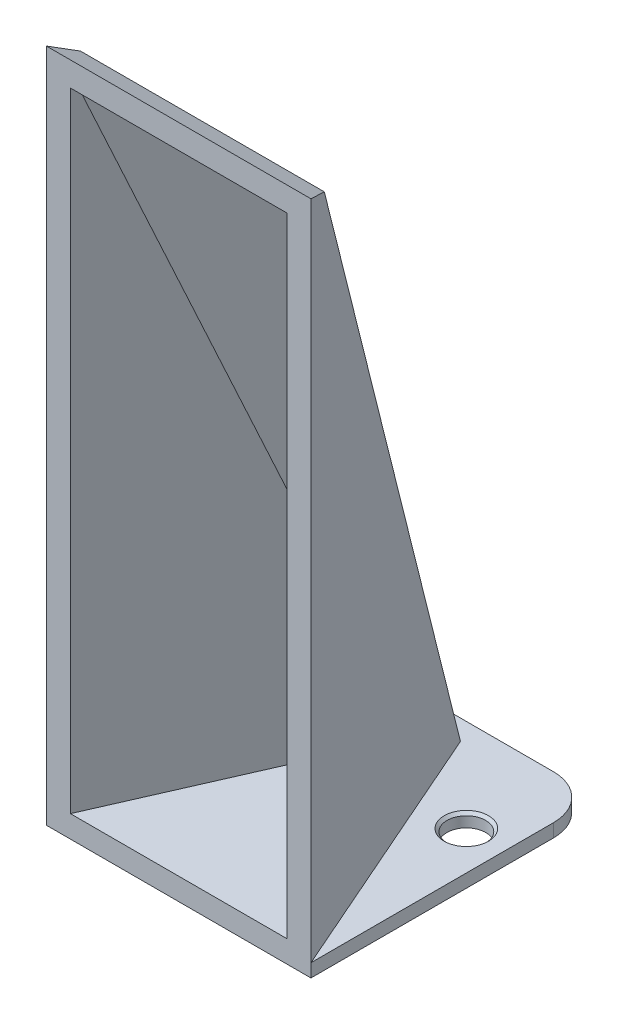
ISO-10303-21;
HEADER;
FILE_DESCRIPTION(('STEP AP214'),'2;1');
FILE_NAME('part.step','',(''),(''),'','','');
FILE_SCHEMA(('AUTOMOTIVE_DESIGN { 1 0 10303 214 1 1 1 1 }'));
ENDSEC;
DATA;
#1=APPLICATION_CONTEXT('core data for automotive mechanical design processes');
#2=APPLICATION_PROTOCOL_DEFINITION('international standard','automotive_design',2000,#1);
#3=PRODUCT_CONTEXT('',#1,'mechanical');
#4=PRODUCT('Part','Part','',(#3));
#5=PRODUCT_RELATED_PRODUCT_CATEGORY('part','',(#4));
#6=PRODUCT_DEFINITION_FORMATION('','',#4);
#7=PRODUCT_DEFINITION_CONTEXT('part definition',#1,'design');
#8=PRODUCT_DEFINITION('design','',#6,#7);
#9=PRODUCT_DEFINITION_SHAPE('','',#8);
#10=(LENGTH_UNIT() NAMED_UNIT(*) SI_UNIT(.MILLI.,.METRE.));
#11=(NAMED_UNIT(*) PLANE_ANGLE_UNIT() SI_UNIT($,.RADIAN.));
#12=(NAMED_UNIT(*) SI_UNIT($,.STERADIAN.) SOLID_ANGLE_UNIT());
#13=UNCERTAINTY_MEASURE_WITH_UNIT(LENGTH_MEASURE(1.E-05),#10,'distance_accuracy_value','');
#14=(GEOMETRIC_REPRESENTATION_CONTEXT(3) GLOBAL_UNCERTAINTY_ASSIGNED_CONTEXT((#13)) GLOBAL_UNIT_ASSIGNED_CONTEXT((#10,
#11,#12)) REPRESENTATION_CONTEXT('',''));
#15=CARTESIAN_POINT('',(0.,0.,0.));
#16=DIRECTION('',(0.,0.,1.));
#17=DIRECTION('',(1.,0.,0.));
#18=AXIS2_PLACEMENT_3D('',#15,#16,#17);
#19=CARTESIAN_POINT('',(0.,3.,0.));
#20=DIRECTION('',(0.,0.,-1.));
#21=DIRECTION('',(-1.,0.,0.));
#22=AXIS2_PLACEMENT_3D('',#19,#20,#21);
#23=PLANE('',#22);
#24=DIRECTION('',(1.,0.,0.));
#25=VECTOR('',#24,1.);
#26=CARTESIAN_POINT('',(0.,0.,0.));
#27=LINE('',#26,#25);
#28=CARTESIAN_POINT('',(0.,0.,0.));
#29=VERTEX_POINT('',#28);
#30=CARTESIAN_POINT('',(60.,0.,0.));
#31=VERTEX_POINT('',#30);
#32=EDGE_CURVE('E258',#29,#31,#27,.T.);
#33=ORIENTED_EDGE('',*,*,#32,.T.);
#34=DIRECTION('',(0.,-1.,0.));
#35=VECTOR('',#34,1.);
#36=CARTESIAN_POINT('',(60.,3.,0.));
#37=LINE('',#36,#35);
#38=CARTESIAN_POINT('',(60.,3.,0.));
#39=VERTEX_POINT('',#38);
#40=EDGE_CURVE('E255',#39,#31,#37,.T.);
#41=ORIENTED_EDGE('',*,*,#40,.F.);
#42=DIRECTION('',(0.,-1.,0.));
#43=VECTOR('',#42,1.);
#44=CARTESIAN_POINT('',(60.,153.,0.));
#45=LINE('',#44,#43);
#46=CARTESIAN_POINT('',(60.,153.,0.));
#47=VERTEX_POINT('',#46);
#48=EDGE_CURVE('E225',#47,#39,#45,.T.);
#49=ORIENTED_EDGE('',*,*,#48,.F.);
#50=DIRECTION('',(1.,0.,0.));
#51=VECTOR('',#50,1.);
#52=CARTESIAN_POINT('',(0.,153.,0.));
#53=LINE('',#52,#51);
#54=CARTESIAN_POINT('',(0.,153.,0.));
#55=VERTEX_POINT('',#54);
#56=EDGE_CURVE('E222',#55,#47,#53,.T.);
#57=ORIENTED_EDGE('',*,*,#56,.F.);
#58=DIRECTION('',(0.,-1.,0.));
#59=VECTOR('',#58,1.);
#60=CARTESIAN_POINT('',(0.,153.,0.));
#61=LINE('',#60,#59);
#62=CARTESIAN_POINT('',(0.,3.,0.));
#63=VERTEX_POINT('',#62);
#64=EDGE_CURVE('E239',#55,#63,#61,.T.);
#65=ORIENTED_EDGE('',*,*,#64,.T.);
#66=DIRECTION('',(0.,-1.,0.));
#67=VECTOR('',#66,1.);
#68=CARTESIAN_POINT('',(0.,3.,0.));
#69=LINE('',#68,#67);
#70=EDGE_CURVE('E271',#63,#29,#69,.T.);
#71=ORIENTED_EDGE('',*,*,#70,.T.);
#72=EDGE_LOOP('',(#33,#41,#49,#57,#65,#71));
#73=FACE_BOUND('',#72,.T.);
#74=DIRECTION('',(0.,-1.,0.));
#75=VECTOR('',#74,1.);
#76=CARTESIAN_POINT('',(5.4601731754912,3.,0.));
#77=LINE('',#76,#75);
#78=CARTESIAN_POINT('',(5.4601731754912,147.484719584209,0.));
#79=VERTEX_POINT('',#78);
#80=CARTESIAN_POINT('',(5.4601731754912,5.,0.));
#81=VERTEX_POINT('',#80);
#82=EDGE_CURVE('E186',#79,#81,#77,.T.);
#83=ORIENTED_EDGE('',*,*,#82,.F.);
#84=DIRECTION('',(1.,0.,0.));
#85=VECTOR('',#84,1.);
#86=CARTESIAN_POINT('',(150.,147.484719584209,0.));
#87=LINE('',#86,#85);
#88=CARTESIAN_POINT('',(54.5398268245088,147.484719584209,0.));
#89=VERTEX_POINT('',#88);
#90=EDGE_CURVE('E178',#79,#89,#87,.T.);
#91=ORIENTED_EDGE('',*,*,#90,.T.);
#92=DIRECTION('',(0.,-1.,0.));
#93=VECTOR('',#92,1.);
#94=CARTESIAN_POINT('',(54.5398268245088,153.,0.));
#95=LINE('',#94,#93);
#96=CARTESIAN_POINT('',(54.5398268245088,5.00000000000003,0.));
#97=VERTEX_POINT('',#96);
#98=EDGE_CURVE('E163',#89,#97,#95,.T.);
#99=ORIENTED_EDGE('',*,*,#98,.T.);
#100=DIRECTION('',(1.,0.,0.));
#101=VECTOR('',#100,1.);
#102=CARTESIAN_POINT('',(0.,5.,0.));
#103=LINE('',#102,#101);
#104=EDGE_CURVE('E181',#81,#97,#103,.T.);
#105=ORIENTED_EDGE('',*,*,#104,.F.);
#106=EDGE_LOOP('',(#83,#91,#99,#105));
#107=FACE_BOUND('',#106,.T.);
#108=ADVANCED_FACE('F49',(#73,#107),#23,.F.);
#109=CARTESIAN_POINT('',(0.,3.,0.));
#110=DIRECTION('',(0.,-1.,0.));
#111=DIRECTION('',(0.,0.,-1.));
#112=AXIS2_PLACEMENT_3D('',#109,#110,#111);
#113=PLANE('',#112);
#114=CARTESIAN_POINT('',(51.25,3.,-43.9809153789311));
#115=DIRECTION('',(0.,1.,0.));
#116=DIRECTION('',(0.,0.,1.));
#117=AXIS2_PLACEMENT_3D('',#114,#115,#116);
#118=CIRCLE('',#117,5.025);
#119=CARTESIAN_POINT('',(51.25,3.,-38.9559153789311));
#120=VERTEX_POINT('',#119);
#121=EDGE_CURVE('E403',#120,#120,#118,.T.);
#122=ORIENTED_EDGE('',*,*,#121,.F.);
#123=EDGE_LOOP('',(#122));
#124=FACE_BOUND('',#123,.T.);
#125=CARTESIAN_POINT('',(8.75,3.,-43.9809153789311));
#126=DIRECTION('',(0.,1.,0.));
#127=DIRECTION('',(0.,0.,1.));
#128=AXIS2_PLACEMENT_3D('',#125,#126,#127);
#129=CIRCLE('',#128,5.025);
#130=CARTESIAN_POINT('',(8.75,3.,-38.9559153789311));
#131=VERTEX_POINT('',#130);
#132=EDGE_CURVE('E413',#131,#131,#129,.T.);
#133=ORIENTED_EDGE('',*,*,#132,.F.);
#134=EDGE_LOOP('',(#133));
#135=FACE_BOUND('',#134,.T.);
#136=DIRECTION('',(0.,0.,-1.));
#137=VECTOR('',#136,1.);
#138=CARTESIAN_POINT('',(60.,3.,0.));
#139=LINE('',#138,#137);
#140=CARTESIAN_POINT('',(60.,3.,-55.));
#141=VERTEX_POINT('',#140);
#142=EDGE_CURVE('E247',#39,#141,#139,.T.);
#143=ORIENTED_EDGE('',*,*,#142,.T.);
#144=CARTESIAN_POINT('',(50.,3.,-55.));
#145=DIRECTION('',(0.,-1.,0.));
#146=DIRECTION('',(0.,0.,-1.));
#147=AXIS2_PLACEMENT_3D('',#144,#145,#146);
#148=CIRCLE('',#147,10.);
#149=CARTESIAN_POINT('',(50.,3.,-65.));
#150=VERTEX_POINT('',#149);
#151=EDGE_CURVE('E58',#141,#150,#148,.F.);
#152=ORIENTED_EDGE('',*,*,#151,.T.);
#153=DIRECTION('',(-1.,0.,0.));
#154=VECTOR('',#153,1.);
#155=CARTESIAN_POINT('',(0.,3.,-65.));
#156=LINE('',#155,#154);
#157=CARTESIAN_POINT('',(10.,3.,-65.));
#158=VERTEX_POINT('',#157);
#159=EDGE_CURVE('E252',#150,#158,#156,.T.);
#160=ORIENTED_EDGE('',*,*,#159,.T.);
#161=CARTESIAN_POINT('',(10.,3.,-55.));
#162=DIRECTION('',(0.,-1.,0.));
#163=DIRECTION('',(0.,0.,-1.));
#164=AXIS2_PLACEMENT_3D('',#161,#162,#163);
#165=CIRCLE('',#164,10.);
#166=CARTESIAN_POINT('',(0.,3.,-55.));
#167=VERTEX_POINT('',#166);
#168=EDGE_CURVE('E73',#158,#167,#165,.F.);
#169=ORIENTED_EDGE('',*,*,#168,.T.);
#170=DIRECTION('',(0.,0.,1.));
#171=VECTOR('',#170,1.);
#172=CARTESIAN_POINT('',(0.,3.,0.));
#173=LINE('',#172,#171);
#174=EDGE_CURVE('E244',#167,#63,#173,.T.);
#175=ORIENTED_EDGE('',*,*,#174,.T.);
#176=DIRECTION('',(-0.401812709745102,0.,0.91572187168774));
#177=VECTOR('',#176,1.);
#178=CARTESIAN_POINT('',(26.5,3.,-60.3928870620323));
#179=LINE('',#178,#177);
#180=CARTESIAN_POINT('',(26.5,3.,-60.3928870620323));
#181=VERTEX_POINT('',#180);
#182=EDGE_CURVE('E221',#181,#63,#179,.T.);
#183=ORIENTED_EDGE('',*,*,#182,.F.);
#184=DIRECTION('',(-1.,0.,0.));
#185=VECTOR('',#184,1.);
#186=CARTESIAN_POINT('',(33.5,3.,-60.3928870620323));
#187=LINE('',#186,#185);
#188=CARTESIAN_POINT('',(33.5,3.,-60.3928870620323));
#189=VERTEX_POINT('',#188);
#190=EDGE_CURVE('E226',#189,#181,#187,.T.);
#191=ORIENTED_EDGE('',*,*,#190,.F.);
#192=DIRECTION('',(-0.401812709745102,0.,-0.91572187168774));
#193=VECTOR('',#192,1.);
#194=CARTESIAN_POINT('',(60.,3.,0.));
#195=LINE('',#194,#193);
#196=EDGE_CURVE('E230',#39,#189,#195,.T.);
#197=ORIENTED_EDGE('',*,*,#196,.F.);
#198=EDGE_LOOP('',(#143,#152,#160,#169,#175,#183,#191,#197));
#199=FACE_BOUND('',#198,.T.);
#200=ADVANCED_FACE('F295',(#124,#135,#199),#113,.F.);
#201=CARTESIAN_POINT('',(0.,3.,0.));
#202=DIRECTION('',(1.,0.,0.));
#203=DIRECTION('',(0.,0.,-1.));
#204=AXIS2_PLACEMENT_3D('',#201,#202,#203);
#205=PLANE('',#204);
#206=ORIENTED_EDGE('',*,*,#174,.F.);
#207=DIRECTION('',(0.,-1.,0.));
#208=VECTOR('',#207,1.);
#209=CARTESIAN_POINT('',(0.,3.,-55.));
#210=LINE('',#209,#208);
#211=CARTESIAN_POINT('',(0.,0.,-55.));
#212=VERTEX_POINT('',#211);
#213=EDGE_CURVE('E11',#167,#212,#210,.T.);
#214=ORIENTED_EDGE('',*,*,#213,.T.);
#215=DIRECTION('',(0.,0.,1.));
#216=VECTOR('',#215,1.);
#217=CARTESIAN_POINT('',(0.,0.,0.));
#218=LINE('',#217,#216);
#219=EDGE_CURVE('E243',#212,#29,#218,.T.);
#220=ORIENTED_EDGE('',*,*,#219,.T.);
#221=ORIENTED_EDGE('',*,*,#70,.F.);
#222=EDGE_LOOP('',(#206,#214,#220,#221));
#223=FACE_BOUND('',#222,.T.);
#224=ADVANCED_FACE('F319',(#223),#205,.F.);
#225=CARTESIAN_POINT('',(60.,3.,0.));
#226=DIRECTION('',(-1.,0.,0.));
#227=DIRECTION('',(0.,0.,1.));
#228=AXIS2_PLACEMENT_3D('',#225,#226,#227);
#229=PLANE('',#228);
#230=DIRECTION('',(0.,0.,-1.));
#231=VECTOR('',#230,1.);
#232=CARTESIAN_POINT('',(60.,0.,0.));
#233=LINE('',#232,#231);
#234=CARTESIAN_POINT('',(60.,0.,-55.));
#235=VERTEX_POINT('',#234);
#236=EDGE_CURVE('E261',#31,#235,#233,.T.);
#237=ORIENTED_EDGE('',*,*,#236,.T.);
#238=DIRECTION('',(0.,-1.,0.));
#239=VECTOR('',#238,1.);
#240=CARTESIAN_POINT('',(60.,3.,-55.));
#241=LINE('',#240,#239);
#242=EDGE_CURVE('E288',#235,#141,#241,.F.);
#243=ORIENTED_EDGE('',*,*,#242,.T.);
#244=ORIENTED_EDGE('',*,*,#142,.F.);
#245=ORIENTED_EDGE('',*,*,#40,.T.);
#246=EDGE_LOOP('',(#237,#243,#244,#245));
#247=FACE_BOUND('',#246,.T.);
#248=ADVANCED_FACE('F310',(#247),#229,.F.);
#249=CARTESIAN_POINT('',(0.,3.,-65.));
#250=DIRECTION('',(0.,0.,1.));
#251=DIRECTION('',(1.,0.,0.));
#252=AXIS2_PLACEMENT_3D('',#249,#250,#251);
#253=PLANE('',#252);
#254=ORIENTED_EDGE('',*,*,#159,.F.);
#255=DIRECTION('',(0.,-1.,0.));
#256=VECTOR('',#255,1.);
#257=CARTESIAN_POINT('',(50.,3.,-65.));
#258=LINE('',#257,#256);
#259=CARTESIAN_POINT('',(50.,0.,-65.));
#260=VERTEX_POINT('',#259);
#261=EDGE_CURVE('E278',#150,#260,#258,.T.);
#262=ORIENTED_EDGE('',*,*,#261,.T.);
#263=DIRECTION('',(-1.,0.,0.));
#264=VECTOR('',#263,1.);
#265=CARTESIAN_POINT('',(0.,0.,-65.));
#266=LINE('',#265,#264);
#267=CARTESIAN_POINT('',(10.,0.,-65.));
#268=VERTEX_POINT('',#267);
#269=EDGE_CURVE('E248',#260,#268,#266,.T.);
#270=ORIENTED_EDGE('',*,*,#269,.T.);
#271=DIRECTION('',(0.,-1.,0.));
#272=VECTOR('',#271,1.);
#273=CARTESIAN_POINT('',(10.,3.,-65.));
#274=LINE('',#273,#272);
#275=EDGE_CURVE('E275',#268,#158,#274,.F.);
#276=ORIENTED_EDGE('',*,*,#275,.T.);
#277=EDGE_LOOP('',(#254,#262,#270,#276));
#278=FACE_BOUND('',#277,.T.);
#279=ADVANCED_FACE('F301',(#278),#253,.F.);
#280=CARTESIAN_POINT('',(0.,0.,0.));
#281=DIRECTION('',(0.,-1.,0.));
#282=DIRECTION('',(0.,0.,-1.));
#283=AXIS2_PLACEMENT_3D('',#280,#281,#282);
#284=PLANE('',#283);
#285=CARTESIAN_POINT('',(51.25,0.,-43.9809153789311));
#286=DIRECTION('',(0.,1.,0.));
#287=DIRECTION('',(0.,0.,1.));
#288=AXIS2_PLACEMENT_3D('',#285,#286,#287);
#289=CIRCLE('',#288,4.39999999999999);
#290=CARTESIAN_POINT('',(51.25,0.,-39.5809153789311));
#291=VERTEX_POINT('',#290);
#292=EDGE_CURVE('E407',#291,#291,#289,.T.);
#293=ORIENTED_EDGE('',*,*,#292,.T.);
#294=EDGE_LOOP('',(#293));
#295=FACE_BOUND('',#294,.T.);
#296=CARTESIAN_POINT('',(8.75,0.,-43.9809153789311));
#297=DIRECTION('',(0.,1.,0.));
#298=DIRECTION('',(0.,0.,1.));
#299=AXIS2_PLACEMENT_3D('',#296,#297,#298);
#300=CIRCLE('',#299,4.4);
#301=CARTESIAN_POINT('',(8.75,0.,-39.5809153789311));
#302=VERTEX_POINT('',#301);
#303=EDGE_CURVE('E169',#302,#302,#300,.T.);
#304=ORIENTED_EDGE('',*,*,#303,.T.);
#305=EDGE_LOOP('',(#304));
#306=FACE_BOUND('',#305,.T.);
#307=ORIENTED_EDGE('',*,*,#269,.F.);
#308=CARTESIAN_POINT('',(50.,0.,-55.));
#309=DIRECTION('',(0.,-1.,0.));
#310=DIRECTION('',(0.,0.,-1.));
#311=AXIS2_PLACEMENT_3D('',#308,#309,#310);
#312=CIRCLE('',#311,10.);
#313=EDGE_CURVE('E285',#260,#235,#312,.T.);
#314=ORIENTED_EDGE('',*,*,#313,.T.);
#315=ORIENTED_EDGE('',*,*,#236,.F.);
#316=ORIENTED_EDGE('',*,*,#32,.F.);
#317=ORIENTED_EDGE('',*,*,#219,.F.);
#318=CARTESIAN_POINT('',(10.,0.,-55.));
#319=DIRECTION('',(0.,-1.,0.));
#320=DIRECTION('',(0.,0.,-1.));
#321=AXIS2_PLACEMENT_3D('',#318,#319,#320);
#322=CIRCLE('',#321,10.);
#323=EDGE_CURVE('E282',#212,#268,#322,.T.);
#324=ORIENTED_EDGE('',*,*,#323,.T.);
#325=EDGE_LOOP('',(#307,#314,#315,#316,#317,#324));
#326=FACE_BOUND('',#325,.T.);
#327=ADVANCED_FACE('F307',(#295,#306,#326),#284,.T.);
#328=CARTESIAN_POINT('',(26.5,153.,-60.3928870620323));
#329=DIRECTION('',(0.91572187168774,0.,0.401812709745102));
#330=DIRECTION('',(0.401812709745102,0.,-0.91572187168774));
#331=AXIS2_PLACEMENT_3D('',#328,#329,#330);
#332=PLANE('',#331);
#333=ORIENTED_EDGE('',*,*,#64,.F.);
#334=DIRECTION('',(0.369626086704801,-0.392161337537618,-0.842369302246943));
#335=VECTOR('',#334,1.);
#336=CARTESIAN_POINT('',(22.4245513615287,129.208275411466,-51.1050338790017));
#337=LINE('',#336,#335);
#338=CARTESIAN_POINT('',(2.36589220792604,150.489864795525,-5.39181361940447));
#339=VERTEX_POINT('',#338);
#340=EDGE_CURVE('E209',#55,#339,#337,.T.);
#341=ORIENTED_EDGE('',*,*,#340,.T.);
#342=DIRECTION('',(0.151547747986444,-0.926148049605033,-0.345373812401912));
#343=VECTOR('',#342,1.);
#344=CARTESIAN_POINT('',(5.44665231704794,131.662531468081,-12.4127946509295));
#345=LINE('',#344,#343);
#346=EDGE_CURVE('E217',#339,#181,#345,.T.);
#347=ORIENTED_EDGE('',*,*,#346,.T.);
#348=ORIENTED_EDGE('',*,*,#182,.T.);
#349=EDGE_LOOP('',(#333,#341,#347,#348));
#350=FACE_BOUND('',#349,.T.);
#351=ADVANCED_FACE('F351',(#350),#332,.F.);
#352=CARTESIAN_POINT('',(60.,153.,0.));
#353=DIRECTION('',(-0.91572187168774,0.,0.401812709745102));
#354=DIRECTION('',(0.401812709745102,0.,0.91572187168774));
#355=AXIS2_PLACEMENT_3D('',#352,#353,#354);
#356=PLANE('',#355);
#357=DIRECTION('',(0.151547747986444,0.926148049605033,0.345373812401912));
#358=VECTOR('',#357,1.);
#359=CARTESIAN_POINT('',(58.3229671235911,154.6996649068,-3.82191913601051));
#360=LINE('',#359,#358);
#361=CARTESIAN_POINT('',(57.634107792074,150.489864795525,-5.39181361940447));
#362=VERTEX_POINT('',#361);
#363=EDGE_CURVE('E213',#189,#362,#360,.T.);
#364=ORIENTED_EDGE('',*,*,#363,.T.);
#365=DIRECTION('',(0.369626086704801,0.392161337537618,0.842369302246943));
#366=VECTOR('',#365,1.);
#367=CARTESIAN_POINT('',(60.,153.,0.));
#368=LINE('',#367,#366);
#369=EDGE_CURVE('E205',#362,#47,#368,.T.);
#370=ORIENTED_EDGE('',*,*,#369,.T.);
#371=ORIENTED_EDGE('',*,*,#48,.T.);
#372=ORIENTED_EDGE('',*,*,#196,.T.);
#373=EDGE_LOOP('',(#364,#370,#371,#372));
#374=FACE_BOUND('',#373,.T.);
#375=ADVANCED_FACE('F357',(#374),#356,.F.);
#376=CARTESIAN_POINT('',(150.,3.,-60.3928870620323));
#377=DIRECTION('',(0.,-0.34940951392497,0.936970112425533));
#378=DIRECTION('',(0.,-0.936970112425533,-0.34940951392497));
#379=AXIS2_PLACEMENT_3D('',#376,#377,#378);
#380=PLANE('',#379);
#381=DIRECTION('',(-1.,0.,0.));
#382=VECTOR('',#381,1.);
#383=CARTESIAN_POINT('',(150.,150.489864795525,-5.39181361940447));
#384=LINE('',#383,#382);
#385=EDGE_CURVE('E201',#362,#339,#384,.T.);
#386=ORIENTED_EDGE('',*,*,#385,.F.);
#387=ORIENTED_EDGE('',*,*,#363,.F.);
#388=ORIENTED_EDGE('',*,*,#190,.T.);
#389=ORIENTED_EDGE('',*,*,#346,.F.);
#390=EDGE_LOOP('',(#386,#387,#388,#389));
#391=FACE_BOUND('',#390,.T.);
#392=ADVANCED_FACE('F361',(#391),#380,.F.);
#393=CARTESIAN_POINT('',(150.,150.489864795525,-5.39181361940447));
#394=DIRECTION('',(0.,-0.906572218102276,0.422050723687473));
#395=DIRECTION('',(0.,-0.422050723687473,-0.906572218102276));
#396=AXIS2_PLACEMENT_3D('',#393,#394,#395);
#397=PLANE('',#396);
#398=ORIENTED_EDGE('',*,*,#56,.T.);
#399=ORIENTED_EDGE('',*,*,#369,.F.);
#400=ORIENTED_EDGE('',*,*,#385,.T.);
#401=ORIENTED_EDGE('',*,*,#340,.F.);
#402=EDGE_LOOP('',(#398,#399,#400,#401));
#403=FACE_BOUND('',#402,.T.);
#404=ADVANCED_FACE('F330',(#403),#397,.F.);
#405=CARTESIAN_POINT('',(50.,3.,-55.));
#406=DIRECTION('',(0.,-1.,0.));
#407=DIRECTION('',(0.,0.,-1.));
#408=AXIS2_PLACEMENT_3D('',#405,#406,#407);
#409=CYLINDRICAL_SURFACE('',#408,10.);
#410=ORIENTED_EDGE('',*,*,#151,.F.);
#411=ORIENTED_EDGE('',*,*,#242,.F.);
#412=ORIENTED_EDGE('',*,*,#313,.F.);
#413=ORIENTED_EDGE('',*,*,#261,.F.);
#414=EDGE_LOOP('',(#410,#411,#412,#413));
#415=FACE_BOUND('',#414,.T.);
#416=ADVANCED_FACE('F304',(#415),#409,.T.);
#417=CARTESIAN_POINT('',(10.,3.,-55.));
#418=DIRECTION('',(0.,-1.,0.));
#419=DIRECTION('',(0.,0.,-1.));
#420=AXIS2_PLACEMENT_3D('',#417,#418,#419);
#421=CYLINDRICAL_SURFACE('',#420,10.);
#422=ORIENTED_EDGE('',*,*,#168,.F.);
#423=ORIENTED_EDGE('',*,*,#275,.F.);
#424=ORIENTED_EDGE('',*,*,#323,.F.);
#425=ORIENTED_EDGE('',*,*,#213,.F.);
#426=EDGE_LOOP('',(#422,#423,#424,#425));
#427=FACE_BOUND('',#426,.T.);
#428=ADVANCED_FACE('F51',(#427),#421,.T.);
#429=CARTESIAN_POINT('',(150.,1.25295243037515,-55.7080364999046));
#430=DIRECTION('',(0.,-0.34940951392497,0.936970112425533));
#431=DIRECTION('',(0.,-0.936970112425533,-0.34940951392497));
#432=AXIS2_PLACEMENT_3D('',#429,#430,#431);
#433=PLANE('',#432);
#434=DIRECTION('',(0.151547747986444,0.926148049605033,0.345373812401912));
#435=VECTOR('',#434,1.);
#436=CARTESIAN_POINT('',(54.9966654424453,153.430456985147,1.04112464372119));
#437=LINE('',#436,#435);
#438=CARTESIAN_POINT('',(30.7086463743376,5.,-54.3107090370605));
#439=VERTEX_POINT('',#438);
#440=CARTESIAN_POINT('',(53.9153332159332,146.822152039245,-1.42320648957223));
#441=VERTEX_POINT('',#440);
#442=EDGE_CURVE('E148',#439,#441,#437,.T.);
#443=ORIENTED_EDGE('',*,*,#442,.T.);
#444=DIRECTION('',(-1.,0.,0.));
#445=VECTOR('',#444,1.);
#446=CARTESIAN_POINT('',(150.,146.822152039245,-1.42320648957224));
#447=LINE('',#446,#445);
#448=CARTESIAN_POINT('',(6.08466678406676,146.822152039245,-1.42320648957223));
#449=VERTEX_POINT('',#448);
#450=EDGE_CURVE('E151',#441,#449,#447,.T.);
#451=ORIENTED_EDGE('',*,*,#450,.T.);
#452=DIRECTION('',(0.151547747986444,-0.926148049605033,-0.345373812401912));
#453=VECTOR('',#452,1.);
#454=CARTESIAN_POINT('',(8.77295399819377,130.393323546428,-7.54975087119784));
#455=LINE('',#454,#453);
#456=CARTESIAN_POINT('',(29.2913536256624,5.,-54.3107090370605));
#457=VERTEX_POINT('',#456);
#458=EDGE_CURVE('E158',#449,#457,#455,.T.);
#459=ORIENTED_EDGE('',*,*,#458,.T.);
#460=DIRECTION('',(-1.,0.,0.));
#461=VECTOR('',#460,1.);
#462=CARTESIAN_POINT('',(0.,5.,-54.3107090370605));
#463=LINE('',#462,#461);
#464=EDGE_CURVE('E154',#439,#457,#463,.T.);
#465=ORIENTED_EDGE('',*,*,#464,.F.);
#466=EDGE_LOOP('',(#443,#451,#459,#465));
#467=FACE_BOUND('',#466,.T.);
#468=ADVANCED_FACE('F149',(#467),#433,.T.);
#469=CARTESIAN_POINT('',(0.,5.,0.));
#470=DIRECTION('',(0.,-1.,0.));
#471=DIRECTION('',(0.,0.,-1.));
#472=AXIS2_PLACEMENT_3D('',#469,#470,#471);
#473=PLANE('',#472);
#474=ORIENTED_EDGE('',*,*,#464,.T.);
#475=DIRECTION('',(-0.401812709745102,0.,0.91572187168774));
#476=VECTOR('',#475,1.);
#477=CARTESIAN_POINT('',(4.5786093584387,5.,2.00906354872551));
#478=LINE('',#477,#476);
#479=EDGE_CURVE('E196',#457,#81,#478,.T.);
#480=ORIENTED_EDGE('',*,*,#479,.T.);
#481=ORIENTED_EDGE('',*,*,#104,.T.);
#482=DIRECTION('',(0.401812709745102,0.,0.91572187168774));
#483=VECTOR('',#482,1.);
#484=CARTESIAN_POINT('',(55.4213906415613,5.,2.00906354872551));
#485=LINE('',#484,#483);
#486=EDGE_CURVE('E185',#439,#97,#485,.T.);
#487=ORIENTED_EDGE('',*,*,#486,.F.);
#488=EDGE_LOOP('',(#474,#480,#481,#487));
#489=FACE_BOUND('',#488,.T.);
#490=ADVANCED_FACE('F328',(#489),#473,.F.);
#491=CARTESIAN_POINT('',(31.0786093584387,153.,-58.3838235133068));
#492=DIRECTION('',(0.91572187168774,0.,0.401812709745102));
#493=DIRECTION('',(0.401812709745102,0.,-0.91572187168774));
#494=AXIS2_PLACEMENT_3D('',#491,#492,#493);
#495=PLANE('',#494);
#496=ORIENTED_EDGE('',*,*,#458,.F.);
#497=DIRECTION('',(0.369626086704801,-0.392161337537618,-0.842369302246943));
#498=VECTOR('',#497,1.);
#499=CARTESIAN_POINT('',(26.3392800970313,125.332661622235,-47.5830017459874));
#500=LINE('',#499,#498);
#501=EDGE_CURVE('E159',#79,#449,#500,.T.);
#502=ORIENTED_EDGE('',*,*,#501,.F.);
#503=ORIENTED_EDGE('',*,*,#82,.T.);
#504=ORIENTED_EDGE('',*,*,#479,.F.);
#505=EDGE_LOOP('',(#496,#502,#503,#504));
#506=FACE_BOUND('',#505,.T.);
#507=ADVANCED_FACE('F373',(#506),#495,.T.);
#508=CARTESIAN_POINT('',(55.4213906415613,153.,2.00906354872551));
#509=DIRECTION('',(-0.91572187168774,0.,0.401812709745102));
#510=DIRECTION('',(0.401812709745102,0.,0.91572187168774));
#511=AXIS2_PLACEMENT_3D('',#508,#509,#510);
#512=PLANE('',#511);
#513=ORIENTED_EDGE('',*,*,#486,.T.);
#514=ORIENTED_EDGE('',*,*,#98,.F.);
#515=DIRECTION('',(0.369626086704801,0.392161337537618,0.842369302246943));
#516=VECTOR('',#515,1.);
#517=CARTESIAN_POINT('',(56.0852712644975,149.124386210769,3.52203213301438));
#518=LINE('',#517,#516);
#519=EDGE_CURVE('E65',#441,#89,#518,.T.);
#520=ORIENTED_EDGE('',*,*,#519,.F.);
#521=ORIENTED_EDGE('',*,*,#442,.F.);
#522=EDGE_LOOP('',(#513,#514,#520,#521));
#523=FACE_BOUND('',#522,.T.);
#524=ADVANCED_FACE('F161',(#523),#512,.T.);
#525=CARTESIAN_POINT('',(150.,145.957003705014,-3.2815600009671));
#526=DIRECTION('',(0.,-0.906572218102276,0.422050723687473));
#527=DIRECTION('',(0.,-0.422050723687473,-0.906572218102276));
#528=AXIS2_PLACEMENT_3D('',#525,#526,#527);
#529=PLANE('',#528);
#530=ORIENTED_EDGE('',*,*,#90,.F.);
#531=ORIENTED_EDGE('',*,*,#501,.T.);
#532=ORIENTED_EDGE('',*,*,#450,.F.);
#533=ORIENTED_EDGE('',*,*,#519,.T.);
#534=EDGE_LOOP('',(#530,#531,#532,#533));
#535=FACE_BOUND('',#534,.T.);
#536=ADVANCED_FACE('F167',(#535),#529,.T.);
#537=CARTESIAN_POINT('',(8.75,3.,-43.9809153789311));
#538=DIRECTION('',(0.,1.,0.));
#539=DIRECTION('',(0.,0.,1.));
#540=AXIS2_PLACEMENT_3D('',#537,#538,#539);
#541=CYLINDRICAL_SURFACE('',#540,4.39999999999999);
#542=ORIENTED_EDGE('',*,*,#303,.F.);
#543=EDGE_LOOP('',(#542));
#544=FACE_BOUND('',#543,.T.);
#545=CARTESIAN_POINT('',(8.75,2.37499999999999,-43.9809153789311));
#546=DIRECTION('',(0.,1.,0.));
#547=DIRECTION('',(0.,0.,1.));
#548=AXIS2_PLACEMENT_3D('',#545,#546,#547);
#549=CIRCLE('',#548,4.39999999999999);
#550=CARTESIAN_POINT('',(8.75,2.37499999999999,-39.5809153789311));
#551=VERTEX_POINT('',#550);
#552=EDGE_CURVE('E173',#551,#551,#549,.T.);
#553=ORIENTED_EDGE('',*,*,#552,.T.);
#554=EDGE_LOOP('',(#553));
#555=FACE_BOUND('',#554,.T.);
#556=ADVANCED_FACE('F369',(#544,#555),#541,.F.);
#557=CARTESIAN_POINT('',(8.75,3.,-43.9809153789311));
#558=DIRECTION('',(0.,1.,0.));
#559=DIRECTION('',(0.,0.,1.));
#560=AXIS2_PLACEMENT_3D('',#557,#558,#559);
#561=CONICAL_SURFACE('',#560,5.025,0.785398163397447);
#562=ORIENTED_EDGE('',*,*,#552,.F.);
#563=EDGE_LOOP('',(#562));
#564=FACE_BOUND('',#563,.T.);
#565=ORIENTED_EDGE('',*,*,#132,.T.);
#566=EDGE_LOOP('',(#565));
#567=FACE_BOUND('',#566,.T.);
#568=ADVANCED_FACE('F382',(#564,#567),#561,.F.);
#569=CARTESIAN_POINT('',(51.25,3.,-43.9809153789311));
#570=DIRECTION('',(0.,1.,0.));
#571=DIRECTION('',(0.,0.,1.));
#572=AXIS2_PLACEMENT_3D('',#569,#570,#571);
#573=CYLINDRICAL_SURFACE('',#572,4.39999999999999);
#574=ORIENTED_EDGE('',*,*,#292,.F.);
#575=EDGE_LOOP('',(#574));
#576=FACE_BOUND('',#575,.T.);
#577=CARTESIAN_POINT('',(51.25,2.37499999999999,-43.9809153789311));
#578=DIRECTION('',(0.,1.,0.));
#579=DIRECTION('',(0.,0.,1.));
#580=AXIS2_PLACEMENT_3D('',#577,#578,#579);
#581=CIRCLE('',#580,4.39999999999999);
#582=CARTESIAN_POINT('',(51.25,2.37499999999999,-39.5809153789311));
#583=VERTEX_POINT('',#582);
#584=EDGE_CURVE('E400',#583,#583,#581,.T.);
#585=ORIENTED_EDGE('',*,*,#584,.T.);
#586=EDGE_LOOP('',(#585));
#587=FACE_BOUND('',#586,.T.);
#588=ADVANCED_FACE('F386',(#576,#587),#573,.F.);
#589=CARTESIAN_POINT('',(51.25,3.,-43.9809153789311));
#590=DIRECTION('',(0.,1.,0.));
#591=DIRECTION('',(0.,0.,1.));
#592=AXIS2_PLACEMENT_3D('',#589,#590,#591);
#593=CONICAL_SURFACE('',#592,5.025,0.785398163397447);
#594=ORIENTED_EDGE('',*,*,#584,.F.);
#595=EDGE_LOOP('',(#594));
#596=FACE_BOUND('',#595,.T.);
#597=ORIENTED_EDGE('',*,*,#121,.T.);
#598=EDGE_LOOP('',(#597));
#599=FACE_BOUND('',#598,.T.);
#600=ADVANCED_FACE('F390',(#596,#599),#593,.F.);
#601=CLOSED_SHELL('',(#108,#200,#224,#248,#279,#327,#351,#375,#392,#404,#416,#428,#468,#490,
#507,#524,#536,#556,#568,#588,#600));
#602=MANIFOLD_SOLID_BREP('B2',#601);
#603=ADVANCED_BREP_SHAPE_REPRESENTATION('',(#18,#602),#14);
#604=SHAPE_DEFINITION_REPRESENTATION(#9,#603);
ENDSEC;
END-ISO-10303-21;
